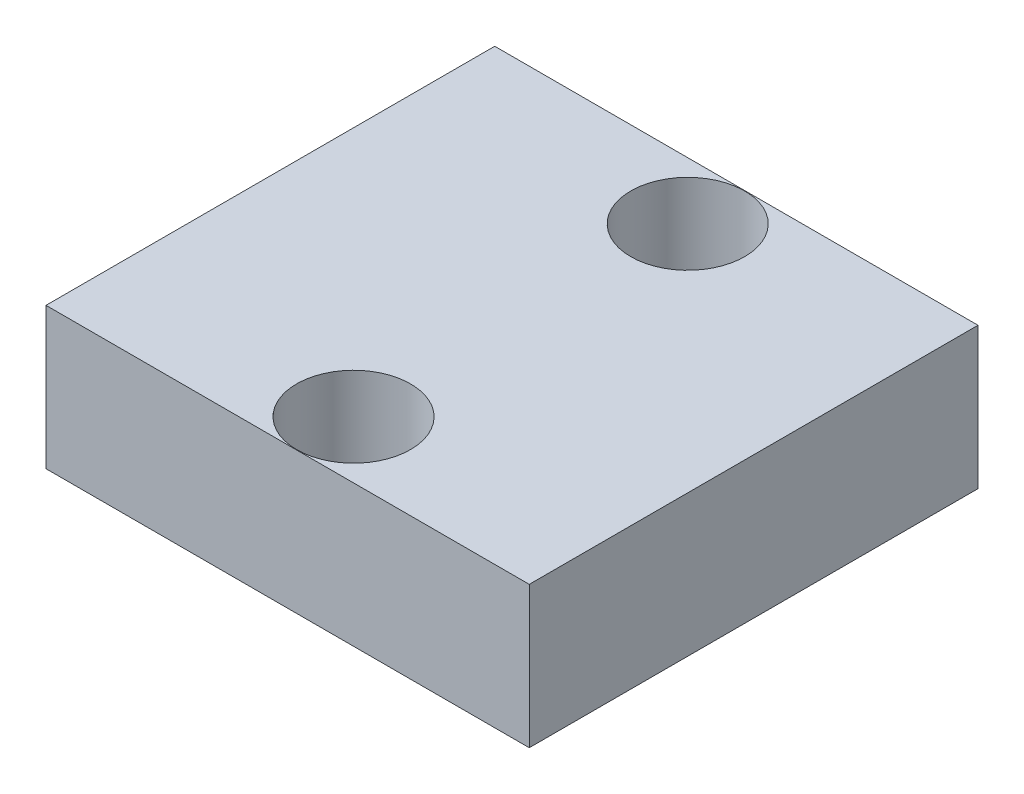
ISO-10303-21;
HEADER;
FILE_DESCRIPTION(('STEP AP214'),'2;1');
FILE_NAME('part.step','',(''),(''),'','','');
FILE_SCHEMA(('AUTOMOTIVE_DESIGN { 1 0 10303 214 1 1 1 1 }'));
ENDSEC;
DATA;
#1=APPLICATION_CONTEXT('core data for automotive mechanical design processes');
#2=APPLICATION_PROTOCOL_DEFINITION('international standard','automotive_design',2000,#1);
#3=PRODUCT_CONTEXT('',#1,'mechanical');
#4=PRODUCT('Part','Part','',(#3));
#5=PRODUCT_RELATED_PRODUCT_CATEGORY('part','',(#4));
#6=PRODUCT_DEFINITION_FORMATION('','',#4);
#7=PRODUCT_DEFINITION_CONTEXT('part definition',#1,'design');
#8=PRODUCT_DEFINITION('design','',#6,#7);
#9=PRODUCT_DEFINITION_SHAPE('','',#8);
#10=(LENGTH_UNIT() NAMED_UNIT(*) SI_UNIT(.MILLI.,.METRE.));
#11=(NAMED_UNIT(*) PLANE_ANGLE_UNIT() SI_UNIT($,.RADIAN.));
#12=(NAMED_UNIT(*) SI_UNIT($,.STERADIAN.) SOLID_ANGLE_UNIT());
#13=UNCERTAINTY_MEASURE_WITH_UNIT(LENGTH_MEASURE(1.E-05),#10,'distance_accuracy_value','');
#14=(GEOMETRIC_REPRESENTATION_CONTEXT(3) GLOBAL_UNCERTAINTY_ASSIGNED_CONTEXT((#13)) GLOBAL_UNIT_ASSIGNED_CONTEXT((#10,
#11,#12)) REPRESENTATION_CONTEXT('',''));
#15=CARTESIAN_POINT('',(0.,0.,0.));
#16=DIRECTION('',(0.,0.,1.));
#17=DIRECTION('',(1.,0.,0.));
#18=AXIS2_PLACEMENT_3D('',#15,#16,#17);
#19=CARTESIAN_POINT('',(0.,4.1,0.));
#20=DIRECTION('',(0.,-1.,0.));
#21=DIRECTION('',(0.,0.,-1.));
#22=AXIS2_PLACEMENT_3D('',#19,#20,#21);
#23=PLANE('',#22);
#24=DIRECTION('',(0.,0.,-1.));
#25=VECTOR('',#24,1.);
#26=CARTESIAN_POINT('',(7.,4.1,6.5));
#27=LINE('',#26,#25);
#28=CARTESIAN_POINT('',(7.,4.1,6.5));
#29=VERTEX_POINT('',#28);
#30=CARTESIAN_POINT('',(7.,4.1,-6.5));
#31=VERTEX_POINT('',#30);
#32=EDGE_CURVE('E86',#29,#31,#27,.T.);
#33=ORIENTED_EDGE('',*,*,#32,.T.);
#34=DIRECTION('',(-1.,0.,0.));
#35=VECTOR('',#34,1.);
#36=CARTESIAN_POINT('',(-7.,4.1,-6.5));
#37=LINE('',#36,#35);
#38=CARTESIAN_POINT('',(-7.,4.1,-6.5));
#39=VERTEX_POINT('',#38);
#40=EDGE_CURVE('E81',#31,#39,#37,.T.);
#41=ORIENTED_EDGE('',*,*,#40,.T.);
#42=DIRECTION('',(0.,0.,1.));
#43=VECTOR('',#42,1.);
#44=CARTESIAN_POINT('',(-7.,4.1,6.5));
#45=LINE('',#44,#43);
#46=CARTESIAN_POINT('',(-7.,4.1,6.5));
#47=VERTEX_POINT('',#46);
#48=EDGE_CURVE('E84',#39,#47,#45,.T.);
#49=ORIENTED_EDGE('',*,*,#48,.T.);
#50=DIRECTION('',(1.,0.,0.));
#51=VECTOR('',#50,1.);
#52=CARTESIAN_POINT('',(-7.,4.1,6.5));
#53=LINE('',#52,#51);
#54=EDGE_CURVE('E51',#47,#29,#53,.T.);
#55=ORIENTED_EDGE('',*,*,#54,.T.);
#56=EDGE_LOOP('',(#33,#41,#49,#55));
#57=FACE_BOUND('',#56,.T.);
#58=CARTESIAN_POINT('',(0.250000000000004,4.1,-4.84));
#59=DIRECTION('',(0.,1.,0.));
#60=DIRECTION('',(0.,0.,1.));
#61=AXIS2_PLACEMENT_3D('',#58,#59,#60);
#62=CIRCLE('',#61,1.65);
#63=CARTESIAN_POINT('',(0.250000000000004,4.1,-3.19));
#64=VERTEX_POINT('',#63);
#65=EDGE_CURVE('E101',#64,#64,#62,.T.);
#66=ORIENTED_EDGE('',*,*,#65,.F.);
#67=EDGE_LOOP('',(#66));
#68=FACE_BOUND('',#67,.T.);
#69=CARTESIAN_POINT('',(0.250000000000004,4.1,4.84));
#70=DIRECTION('',(0.,1.,0.));
#71=DIRECTION('',(0.,0.,1.));
#72=AXIS2_PLACEMENT_3D('',#69,#70,#71);
#73=CIRCLE('',#72,1.65);
#74=CARTESIAN_POINT('',(0.250000000000004,4.1,6.49));
#75=VERTEX_POINT('',#74);
#76=EDGE_CURVE('E116',#75,#75,#73,.T.);
#77=ORIENTED_EDGE('',*,*,#76,.F.);
#78=EDGE_LOOP('',(#77));
#79=FACE_BOUND('',#78,.T.);
#80=ADVANCED_FACE('F34',(#57,#68,#79),#23,.F.);
#81=CARTESIAN_POINT('',(0.,0.,0.));
#82=DIRECTION('',(0.,-1.,0.));
#83=DIRECTION('',(0.,0.,-1.));
#84=AXIS2_PLACEMENT_3D('',#81,#82,#83);
#85=PLANE('',#84);
#86=CARTESIAN_POINT('',(0.250000000000004,0.,-4.84));
#87=DIRECTION('',(0.,1.,0.));
#88=DIRECTION('',(0.,0.,1.));
#89=AXIS2_PLACEMENT_3D('',#86,#87,#88);
#90=CIRCLE('',#89,1.65);
#91=CARTESIAN_POINT('',(0.250000000000004,0.,-3.19));
#92=VERTEX_POINT('',#91);
#93=EDGE_CURVE('E113',#92,#92,#90,.T.);
#94=ORIENTED_EDGE('',*,*,#93,.T.);
#95=EDGE_LOOP('',(#94));
#96=FACE_BOUND('',#95,.T.);
#97=DIRECTION('',(0.,0.,-1.));
#98=VECTOR('',#97,1.);
#99=CARTESIAN_POINT('',(7.,0.,6.5));
#100=LINE('',#99,#98);
#101=CARTESIAN_POINT('',(7.,0.,6.5));
#102=VERTEX_POINT('',#101);
#103=CARTESIAN_POINT('',(7.,0.,-6.5));
#104=VERTEX_POINT('',#103);
#105=EDGE_CURVE('E98',#102,#104,#100,.T.);
#106=ORIENTED_EDGE('',*,*,#105,.F.);
#107=DIRECTION('',(1.,0.,0.));
#108=VECTOR('',#107,1.);
#109=CARTESIAN_POINT('',(-7.,0.,6.5));
#110=LINE('',#109,#108);
#111=CARTESIAN_POINT('',(-7.,0.,6.5));
#112=VERTEX_POINT('',#111);
#113=EDGE_CURVE('E74',#112,#102,#110,.T.);
#114=ORIENTED_EDGE('',*,*,#113,.F.);
#115=DIRECTION('',(0.,0.,1.));
#116=VECTOR('',#115,1.);
#117=CARTESIAN_POINT('',(-7.,0.,6.5));
#118=LINE('',#117,#116);
#119=CARTESIAN_POINT('',(-7.,0.,-6.5));
#120=VERTEX_POINT('',#119);
#121=EDGE_CURVE('E68',#120,#112,#118,.T.);
#122=ORIENTED_EDGE('',*,*,#121,.F.);
#123=DIRECTION('',(-1.,0.,0.));
#124=VECTOR('',#123,1.);
#125=CARTESIAN_POINT('',(-7.,0.,-6.5));
#126=LINE('',#125,#124);
#127=EDGE_CURVE('E90',#104,#120,#126,.T.);
#128=ORIENTED_EDGE('',*,*,#127,.F.);
#129=EDGE_LOOP('',(#106,#114,#122,#128));
#130=FACE_BOUND('',#129,.T.);
#131=CARTESIAN_POINT('',(0.250000000000004,0.,4.84));
#132=DIRECTION('',(0.,1.,0.));
#133=DIRECTION('',(0.,0.,1.));
#134=AXIS2_PLACEMENT_3D('',#131,#132,#133);
#135=CIRCLE('',#134,1.65);
#136=CARTESIAN_POINT('',(0.250000000000004,0.,6.49));
#137=VERTEX_POINT('',#136);
#138=EDGE_CURVE('E119',#137,#137,#135,.T.);
#139=ORIENTED_EDGE('',*,*,#138,.T.);
#140=EDGE_LOOP('',(#139));
#141=FACE_BOUND('',#140,.T.);
#142=ADVANCED_FACE('F109',(#96,#130,#141),#85,.T.);
#143=CARTESIAN_POINT('',(7.,4.1,6.5));
#144=DIRECTION('',(-1.,0.,0.));
#145=DIRECTION('',(0.,0.,1.));
#146=AXIS2_PLACEMENT_3D('',#143,#144,#145);
#147=PLANE('',#146);
#148=ORIENTED_EDGE('',*,*,#105,.T.);
#149=DIRECTION('',(0.,-1.,0.));
#150=VECTOR('',#149,1.);
#151=CARTESIAN_POINT('',(7.,4.1,-6.5));
#152=LINE('',#151,#150);
#153=EDGE_CURVE('E11',#31,#104,#152,.T.);
#154=ORIENTED_EDGE('',*,*,#153,.F.);
#155=ORIENTED_EDGE('',*,*,#32,.F.);
#156=DIRECTION('',(0.,-1.,0.));
#157=VECTOR('',#156,1.);
#158=CARTESIAN_POINT('',(7.,4.1,6.5));
#159=LINE('',#158,#157);
#160=EDGE_CURVE('E94',#29,#102,#159,.T.);
#161=ORIENTED_EDGE('',*,*,#160,.T.);
#162=EDGE_LOOP('',(#148,#154,#155,#161));
#163=FACE_BOUND('',#162,.T.);
#164=ADVANCED_FACE('F36',(#163),#147,.F.);
#165=CARTESIAN_POINT('',(-7.,4.1,-6.5));
#166=DIRECTION('',(0.,0.,1.));
#167=DIRECTION('',(1.,0.,0.));
#168=AXIS2_PLACEMENT_3D('',#165,#166,#167);
#169=PLANE('',#168);
#170=ORIENTED_EDGE('',*,*,#127,.T.);
#171=DIRECTION('',(0.,-1.,0.));
#172=VECTOR('',#171,1.);
#173=CARTESIAN_POINT('',(-7.,4.1,-6.5));
#174=LINE('',#173,#172);
#175=EDGE_CURVE('E43',#39,#120,#174,.T.);
#176=ORIENTED_EDGE('',*,*,#175,.F.);
#177=ORIENTED_EDGE('',*,*,#40,.F.);
#178=ORIENTED_EDGE('',*,*,#153,.T.);
#179=EDGE_LOOP('',(#170,#176,#177,#178));
#180=FACE_BOUND('',#179,.T.);
#181=ADVANCED_FACE('F89',(#180),#169,.F.);
#182=CARTESIAN_POINT('',(-7.,4.1,6.5));
#183=DIRECTION('',(1.,0.,0.));
#184=DIRECTION('',(0.,0.,-1.));
#185=AXIS2_PLACEMENT_3D('',#182,#183,#184);
#186=PLANE('',#185);
#187=ORIENTED_EDGE('',*,*,#121,.T.);
#188=DIRECTION('',(0.,-1.,0.));
#189=VECTOR('',#188,1.);
#190=CARTESIAN_POINT('',(-7.,4.1,6.5));
#191=LINE('',#190,#189);
#192=EDGE_CURVE('E91',#47,#112,#191,.T.);
#193=ORIENTED_EDGE('',*,*,#192,.F.);
#194=ORIENTED_EDGE('',*,*,#48,.F.);
#195=ORIENTED_EDGE('',*,*,#175,.T.);
#196=EDGE_LOOP('',(#187,#193,#194,#195));
#197=FACE_BOUND('',#196,.T.);
#198=ADVANCED_FACE('F92',(#197),#186,.F.);
#199=CARTESIAN_POINT('',(-7.,4.1,6.5));
#200=DIRECTION('',(0.,0.,-1.));
#201=DIRECTION('',(-1.,0.,0.));
#202=AXIS2_PLACEMENT_3D('',#199,#200,#201);
#203=PLANE('',#202);
#204=ORIENTED_EDGE('',*,*,#113,.T.);
#205=ORIENTED_EDGE('',*,*,#160,.F.);
#206=ORIENTED_EDGE('',*,*,#54,.F.);
#207=ORIENTED_EDGE('',*,*,#192,.T.);
#208=EDGE_LOOP('',(#204,#205,#206,#207));
#209=FACE_BOUND('',#208,.T.);
#210=ADVANCED_FACE('F106',(#209),#203,.F.);
#211=CARTESIAN_POINT('',(0.250000000000004,4.1,-4.84));
#212=DIRECTION('',(0.,-1.,0.));
#213=DIRECTION('',(0.,0.,-1.));
#214=AXIS2_PLACEMENT_3D('',#211,#212,#213);
#215=CYLINDRICAL_SURFACE('',#214,1.65);
#216=ORIENTED_EDGE('',*,*,#65,.T.);
#217=EDGE_LOOP('',(#216));
#218=FACE_BOUND('',#217,.T.);
#219=ORIENTED_EDGE('',*,*,#93,.F.);
#220=EDGE_LOOP('',(#219));
#221=FACE_BOUND('',#220,.T.);
#222=ADVANCED_FACE('F136',(#218,#221),#215,.F.);
#223=CARTESIAN_POINT('',(0.250000000000004,4.1,4.84));
#224=DIRECTION('',(0.,-1.,0.));
#225=DIRECTION('',(0.,0.,-1.));
#226=AXIS2_PLACEMENT_3D('',#223,#224,#225);
#227=CYLINDRICAL_SURFACE('',#226,1.65);
#228=ORIENTED_EDGE('',*,*,#76,.T.);
#229=EDGE_LOOP('',(#228));
#230=FACE_BOUND('',#229,.T.);
#231=ORIENTED_EDGE('',*,*,#138,.F.);
#232=EDGE_LOOP('',(#231));
#233=FACE_BOUND('',#232,.T.);
#234=ADVANCED_FACE('F125',(#230,#233),#227,.F.);
#235=CLOSED_SHELL('',(#80,#142,#164,#181,#198,#210,#222,#234));
#236=MANIFOLD_SOLID_BREP('B2',#235);
#237=ADVANCED_BREP_SHAPE_REPRESENTATION('',(#18,#236),#14);
#238=SHAPE_DEFINITION_REPRESENTATION(#9,#237);
ENDSEC;
END-ISO-10303-21;
